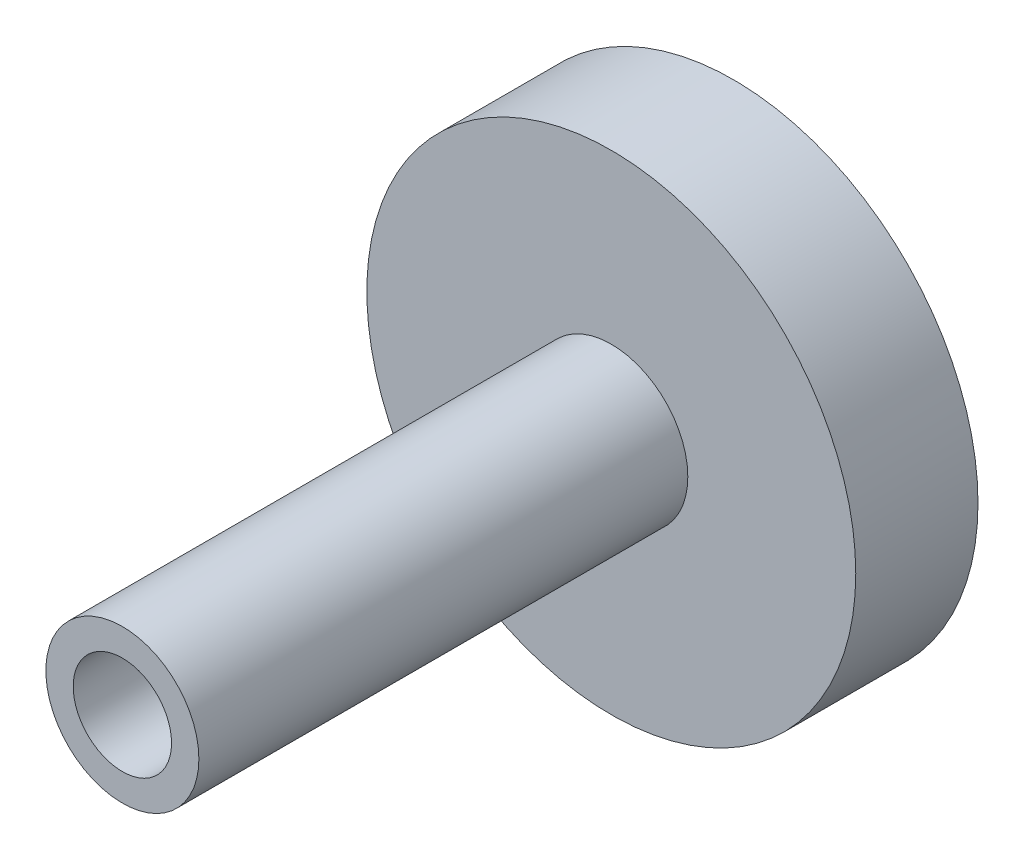
ISO-10303-21;
HEADER;
FILE_DESCRIPTION(('STEP AP214'),'2;1');
FILE_NAME('part.step','',(''),(''),'','','');
FILE_SCHEMA(('AUTOMOTIVE_DESIGN { 1 0 10303 214 1 1 1 1 }'));
ENDSEC;
DATA;
#1=APPLICATION_CONTEXT('core data for automotive mechanical design processes');
#2=APPLICATION_PROTOCOL_DEFINITION('international standard','automotive_design',2000,#1);
#3=PRODUCT_CONTEXT('',#1,'mechanical');
#4=PRODUCT('Part','Part','',(#3));
#5=PRODUCT_RELATED_PRODUCT_CATEGORY('part','',(#4));
#6=PRODUCT_DEFINITION_FORMATION('','',#4);
#7=PRODUCT_DEFINITION_CONTEXT('part definition',#1,'design');
#8=PRODUCT_DEFINITION('design','',#6,#7);
#9=PRODUCT_DEFINITION_SHAPE('','',#8);
#10=(LENGTH_UNIT() NAMED_UNIT(*) SI_UNIT(.MILLI.,.METRE.));
#11=(NAMED_UNIT(*) PLANE_ANGLE_UNIT() SI_UNIT($,.RADIAN.));
#12=(NAMED_UNIT(*) SI_UNIT($,.STERADIAN.) SOLID_ANGLE_UNIT());
#13=UNCERTAINTY_MEASURE_WITH_UNIT(LENGTH_MEASURE(1.E-05),#10,'distance_accuracy_value','');
#14=(GEOMETRIC_REPRESENTATION_CONTEXT(3) GLOBAL_UNCERTAINTY_ASSIGNED_CONTEXT((#13)) GLOBAL_UNIT_ASSIGNED_CONTEXT((#10,
#11,#12)) REPRESENTATION_CONTEXT('',''));
#15=CARTESIAN_POINT('',(0.,0.,0.));
#16=DIRECTION('',(0.,0.,1.));
#17=DIRECTION('',(1.,0.,0.));
#18=AXIS2_PLACEMENT_3D('',#15,#16,#17);
#19=CARTESIAN_POINT('',(0.,0.,31.7499999999997));
#20=DIRECTION('',(0.,0.,0.999999999999995));
#21=DIRECTION('',(1.,0.,0.));
#22=AXIS2_PLACEMENT_3D('',#19,#20,#21);
#23=PLANE('',#22);
#24=CARTESIAN_POINT('',(0.,0.,31.7499999999997));
#25=DIRECTION('',(0.,0.,0.999999999999995));
#26=DIRECTION('',(1.,0.,0.));
#27=AXIS2_PLACEMENT_3D('',#24,#25,#26);
#28=CIRCLE('',#27,2.555);
#29=CARTESIAN_POINT('',(2.55500000000001,0.,31.7499999999997));
#30=VERTEX_POINT('',#29);
#31=EDGE_CURVE('E55',#30,#30,#28,.T.);
#32=ORIENTED_EDGE('',*,*,#31,.F.);
#33=EDGE_LOOP('',(#32));
#34=FACE_BOUND('',#33,.T.);
#35=CARTESIAN_POINT('',(0.,0.,31.7499999999997));
#36=DIRECTION('',(0.,0.,0.999999999999995));
#37=DIRECTION('',(1.,0.,0.));
#38=AXIS2_PLACEMENT_3D('',#35,#36,#37);
#39=CIRCLE('',#38,3.9751);
#40=CARTESIAN_POINT('',(3.97510000000002,0.,31.7499999999997));
#41=VERTEX_POINT('',#40);
#42=EDGE_CURVE('E69',#41,#41,#39,.T.);
#43=ORIENTED_EDGE('',*,*,#42,.T.);
#44=EDGE_LOOP('',(#43));
#45=FACE_BOUND('',#44,.T.);
#46=ADVANCED_FACE('F48',(#34,#45),#23,.T.);
#47=CARTESIAN_POINT('',(0.,0.,31.7499999999997));
#48=DIRECTION('',(0.,0.,-0.999999999999995));
#49=DIRECTION('',(-1.,0.,0.));
#50=AXIS2_PLACEMENT_3D('',#47,#48,#49);
#51=CYLINDRICAL_SURFACE('',#50,12.7);
#52=CARTESIAN_POINT('',(0.,0.,0.));
#53=DIRECTION('',(0.,0.,0.999999999999995));
#54=DIRECTION('',(1.,0.,0.));
#55=AXIS2_PLACEMENT_3D('',#52,#53,#54);
#56=CIRCLE('',#55,12.7);
#57=CARTESIAN_POINT('',(12.7000000000001,0.,0.));
#58=VERTEX_POINT('',#57);
#59=EDGE_CURVE('E12',#58,#58,#56,.T.);
#60=ORIENTED_EDGE('',*,*,#59,.T.);
#61=EDGE_LOOP('',(#60));
#62=FACE_BOUND('',#61,.T.);
#63=CARTESIAN_POINT('',(0.,0.,6.34999999999999));
#64=DIRECTION('',(0.,0.,0.999999999999995));
#65=DIRECTION('',(1.,0.,0.));
#66=AXIS2_PLACEMENT_3D('',#63,#64,#65);
#67=CIRCLE('',#66,12.7);
#68=CARTESIAN_POINT('',(12.7000000000001,0.,6.34999999999999));
#69=VERTEX_POINT('',#68);
#70=EDGE_CURVE('E64',#69,#69,#67,.T.);
#71=ORIENTED_EDGE('',*,*,#70,.F.);
#72=EDGE_LOOP('',(#71));
#73=FACE_BOUND('',#72,.T.);
#74=ADVANCED_FACE('F50',(#62,#73),#51,.T.);
#75=CARTESIAN_POINT('',(0.,0.,0.));
#76=DIRECTION('',(0.,0.,0.999999999999995));
#77=DIRECTION('',(1.,0.,0.));
#78=AXIS2_PLACEMENT_3D('',#75,#76,#77);
#79=PLANE('',#78);
#80=ORIENTED_EDGE('',*,*,#59,.F.);
#81=EDGE_LOOP('',(#80));
#82=FACE_BOUND('',#81,.T.);
#83=CARTESIAN_POINT('',(0.,0.,0.));
#84=DIRECTION('',(0.,0.,0.999999999999995));
#85=DIRECTION('',(1.,0.,0.));
#86=AXIS2_PLACEMENT_3D('',#83,#84,#85);
#87=CIRCLE('',#86,2.555);
#88=CARTESIAN_POINT('',(2.55500000000001,0.,0.));
#89=VERTEX_POINT('',#88);
#90=EDGE_CURVE('E59',#89,#89,#87,.T.);
#91=ORIENTED_EDGE('',*,*,#90,.T.);
#92=EDGE_LOOP('',(#91));
#93=FACE_BOUND('',#92,.T.);
#94=ADVANCED_FACE('F86',(#82,#93),#79,.F.);
#95=CARTESIAN_POINT('',(0.,0.,31.7499999999997));
#96=DIRECTION('',(0.,0.,-0.999999999999995));
#97=DIRECTION('',(-1.,0.,0.));
#98=AXIS2_PLACEMENT_3D('',#95,#96,#97);
#99=CYLINDRICAL_SURFACE('',#98,2.555);
#100=ORIENTED_EDGE('',*,*,#31,.T.);
#101=EDGE_LOOP('',(#100));
#102=FACE_BOUND('',#101,.T.);
#103=ORIENTED_EDGE('',*,*,#90,.F.);
#104=EDGE_LOOP('',(#103));
#105=FACE_BOUND('',#104,.T.);
#106=ADVANCED_FACE('F81',(#102,#105),#99,.F.);
#107=CARTESIAN_POINT('',(0.,0.,6.34999999999999));
#108=DIRECTION('',(0.,0.,0.999999999999995));
#109=DIRECTION('',(1.,0.,0.));
#110=AXIS2_PLACEMENT_3D('',#107,#108,#109);
#111=PLANE('',#110);
#112=CARTESIAN_POINT('',(0.,0.,6.34999999999999));
#113=DIRECTION('',(0.,0.,0.999999999999995));
#114=DIRECTION('',(1.,0.,0.));
#115=AXIS2_PLACEMENT_3D('',#112,#113,#114);
#116=CIRCLE('',#115,3.9751);
#117=CARTESIAN_POINT('',(3.97510000000002,0.,6.34999999999999));
#118=VERTEX_POINT('',#117);
#119=EDGE_CURVE('E68',#118,#118,#116,.T.);
#120=ORIENTED_EDGE('',*,*,#119,.F.);
#121=EDGE_LOOP('',(#120));
#122=FACE_BOUND('',#121,.T.);
#123=ORIENTED_EDGE('',*,*,#70,.T.);
#124=EDGE_LOOP('',(#123));
#125=FACE_BOUND('',#124,.T.);
#126=ADVANCED_FACE('F78',(#122,#125),#111,.T.);
#127=CARTESIAN_POINT('',(0.,0.,6.34999999999999));
#128=DIRECTION('',(0.,0.,0.999999999999995));
#129=DIRECTION('',(1.,0.,0.));
#130=AXIS2_PLACEMENT_3D('',#127,#128,#129);
#131=CYLINDRICAL_SURFACE('',#130,3.9751);
#132=ORIENTED_EDGE('',*,*,#119,.T.);
#133=EDGE_LOOP('',(#132));
#134=FACE_BOUND('',#133,.T.);
#135=ORIENTED_EDGE('',*,*,#42,.F.);
#136=EDGE_LOOP('',(#135));
#137=FACE_BOUND('',#136,.T.);
#138=ADVANCED_FACE('F75',(#134,#137),#131,.T.);
#139=CLOSED_SHELL('',(#46,#74,#94,#106,#126,#138));
#140=MANIFOLD_SOLID_BREP('B2',#139);
#141=ADVANCED_BREP_SHAPE_REPRESENTATION('',(#18,#140),#14);
#142=SHAPE_DEFINITION_REPRESENTATION(#9,#141);
ENDSEC;
END-ISO-10303-21;
